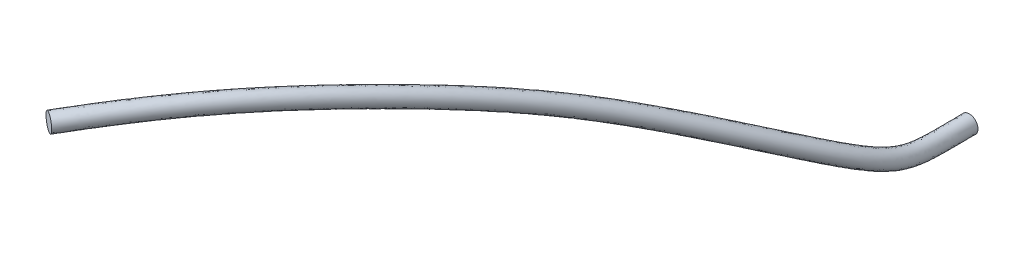
ISO-10303-21;
HEADER;
FILE_DESCRIPTION(('STEP AP214'),'2;1');
FILE_NAME('part.step','',(''),(''),'','','');
FILE_SCHEMA(('AUTOMOTIVE_DESIGN { 1 0 10303 214 1 1 1 1 }'));
ENDSEC;
DATA;
#1=APPLICATION_CONTEXT('core data for automotive mechanical design processes');
#2=APPLICATION_PROTOCOL_DEFINITION('international standard','automotive_design',2000,#1);
#3=PRODUCT_CONTEXT('',#1,'mechanical');
#4=PRODUCT('Part','Part','',(#3));
#5=PRODUCT_RELATED_PRODUCT_CATEGORY('part','',(#4));
#6=PRODUCT_DEFINITION_FORMATION('','',#4);
#7=PRODUCT_DEFINITION_CONTEXT('part definition',#1,'design');
#8=PRODUCT_DEFINITION('design','',#6,#7);
#9=PRODUCT_DEFINITION_SHAPE('','',#8);
#10=(LENGTH_UNIT() NAMED_UNIT(*) SI_UNIT(.MILLI.,.METRE.));
#11=(NAMED_UNIT(*) PLANE_ANGLE_UNIT() SI_UNIT($,.RADIAN.));
#12=(NAMED_UNIT(*) SI_UNIT($,.STERADIAN.) SOLID_ANGLE_UNIT());
#13=UNCERTAINTY_MEASURE_WITH_UNIT(LENGTH_MEASURE(1.E-05),#10,'distance_accuracy_value','');
#14=(GEOMETRIC_REPRESENTATION_CONTEXT(3) GLOBAL_UNCERTAINTY_ASSIGNED_CONTEXT((#13)) GLOBAL_UNIT_ASSIGNED_CONTEXT((#10,
#11,#12)) REPRESENTATION_CONTEXT('',''));
#15=CARTESIAN_POINT('',(0.,0.,0.));
#16=DIRECTION('',(0.,0.,1.));
#17=DIRECTION('',(1.,0.,0.));
#18=AXIS2_PLACEMENT_3D('',#15,#16,#17);
#19=CARTESIAN_POINT('',(0.,0.,0.));
#20=DIRECTION('',(0.,0.,1.));
#21=DIRECTION('',(1.,0.,0.));
#22=AXIS2_PLACEMENT_3D('',#19,#20,#21);
#23=PLANE('',#22);
#24=CARTESIAN_POINT('',(0.,0.,0.));
#25=DIRECTION('',(0.,0.,1.));
#26=DIRECTION('',(1.,0.,0.));
#27=AXIS2_PLACEMENT_3D('',#24,#25,#26);
#28=CIRCLE('',#27,1.15);
#29=CARTESIAN_POINT('',(1.15,0.,0.));
#30=VERTEX_POINT('',#29);
#31=EDGE_CURVE('E40',#30,#30,#28,.T.);
#32=ORIENTED_EDGE('',*,*,#31,.F.);
#33=EDGE_LOOP('',(#32));
#34=FACE_BOUND('',#33,.T.);
#35=ADVANCED_FACE('F33',(#34),#23,.F.);
#36=CARTESIAN_POINT('',(-40.1891861869022,21.1190555910862,82.0495406097306));
#37=DIRECTION('',(-0.523066911051622,-0.0173189381133083,0.852115638247264));
#38=DIRECTION('',(0.839482303165105,0.162216449648336,0.518608991568888));
#39=AXIS2_PLACEMENT_3D('',#36,#37,#38);
#40=PLANE('',#39);
#41=CARTESIAN_POINT('',(-40.1891861869022,21.1190555910862,82.0495406097306));
#42=DIRECTION('',(-0.523066911051622,-0.0173189381133083,0.852115638247264));
#43=DIRECTION('',(0.839482303165105,0.162216449648336,0.518608991568888));
#44=AXIS2_PLACEMENT_3D('',#41,#42,#43);
#45=CIRCLE('',#44,1.15);
#46=CARTESIAN_POINT('',(-39.2237815382624,21.3056045081818,82.6459409500348));
#47=VERTEX_POINT('',#46);
#48=EDGE_CURVE('E11',#47,#47,#45,.T.);
#49=ORIENTED_EDGE('',*,*,#48,.T.);
#50=EDGE_LOOP('',(#49));
#51=FACE_BOUND('',#50,.T.);
#52=ADVANCED_FACE('F47',(#51),#40,.T.);
#53=CARTESIAN_POINT('',(1.15,0.,0.));
#54=CARTESIAN_POINT('',(1.15000000144366,-7.20211161642477E-10,1.95143650964167));
#55=CARTESIAN_POINT('',(1.20622590283796,0.0180084902922004,3.51269738991182));
#56=CARTESIAN_POINT('',(1.28013739089192,0.168570841201481,6.23684377893701));
#57=CARTESIAN_POINT('',(1.29893429024295,0.301479833944161,7.4050627006684));
#58=CARTESIAN_POINT('',(1.12787614204195,0.77873712711421,9.69393493904792));
#59=CARTESIAN_POINT('',(0.934272869510342,1.12474594820879,10.8074515445958));
#60=CARTESIAN_POINT('',(0.189155180938306,2.07661842014926,13.2272806110371));
#61=CARTESIAN_POINT('',(-0.358717878546888,2.67981038190878,14.5346246022732));
#62=CARTESIAN_POINT('',(-2.40118231195554,4.64877181739815,18.6085088504666));
#63=CARTESIAN_POINT('',(-4.25852590368728,6.25441666013519,21.7817112451415));
#64=CARTESIAN_POINT('',(-8.39487169455971,9.60212919484409,28.7242194629464));
#65=CARTESIAN_POINT('',(-10.6722892268256,11.3418492196251,32.4883301998899));
#66=CARTESIAN_POINT('',(-16.1943113291562,15.2182645999995,42.1629616253261));
#67=CARTESIAN_POINT('',(-19.1049742099855,16.873554675777,47.8851708296531));
#68=CARTESIAN_POINT('',(-28.6572772561788,21.2475742907675,65.8311498474764));
#69=CARTESIAN_POINT('',(-33.8674574316434,21.4829543743858,73.920083058212));
#70=CARTESIAN_POINT('',(-39.2237815382624,21.3056045081818,82.6459409500348));
#71=CARTESIAN_POINT('',(1.15,2.3,0.));
#72=CARTESIAN_POINT('',(1.15000000151191,2.29999999930247,1.93691349664838));
#73=CARTESIAN_POINT('',(1.20537180512164,2.31877394118791,3.4630667389245));
#74=CARTESIAN_POINT('',(1.27510401661552,2.46080010755252,6.03277211417422));
#75=CARTESIAN_POINT('',(1.2905443755972,2.5820393650124,7.07456933034643));
#76=CARTESIAN_POINT('',(1.14042405579988,3.00135239054872,9.08559952774971));
#77=CARTESIAN_POINT('',(0.97423162480966,3.30269506927493,10.0637658770454));
#78=CARTESIAN_POINT('',(0.278860773719742,4.19112213316196,12.3223196141851));
#79=CARTESIAN_POINT('',(-0.25096579911246,4.7767658894762,13.5957672941097));
#80=CARTESIAN_POINT('',(-2.27549681623206,6.72843932638967,17.6338817739762));
#81=CARTESIAN_POINT('',(-4.13761803841304,8.33919031609541,20.8174997321641));
#82=CARTESIAN_POINT('',(-8.29719603013418,11.7057115446228,27.799014343803));
#83=CARTESIAN_POINT('',(-10.5938352821385,13.4607890788969,31.5942556798542));
#84=CARTESIAN_POINT('',(-16.2076410470252,17.4016358585136,41.4296928960429));
#85=CARTESIAN_POINT('',(-19.1633728120616,19.0815695694952,47.2405885551904));
#86=CARTESIAN_POINT('',(-28.8224850791944,23.5044973280292,65.3872307231536));
#87=CARTESIAN_POINT('',(-34.1725827128342,23.7532494545851,73.7038663408957));
#88=CARTESIAN_POINT('',(-39.5623620785418,23.5747918723732,82.4842253851126));
#89=CARTESIAN_POINT('',(-1.15,2.3,0.));
#90=CARTESIAN_POINT('',(-1.14999999844743,2.29999999931797,1.98109375578373));
#91=CARTESIAN_POINT('',(-1.09335271378284,2.32014159454708,3.54127108178073));
#92=CARTESIAN_POINT('',(-1.02448064835617,2.46042654646795,6.07927407132188));
#93=CARTESIAN_POINT('',(-1.01339852772852,2.57784666356256,7.04467796065394));
#94=CARTESIAN_POINT('',(-1.14336948493598,2.94110196114834,8.7860650291266));
#95=CARTESIAN_POINT('',(-1.27755783968144,3.18688499862361,9.58525494220966));
#96=CARTESIAN_POINT('',(-1.88948260265174,3.96878723043885,11.5727899771709));
#97=CARTESIAN_POINT('',(-2.3751498583266,4.50880916555192,12.7521322882529));
#98=CARTESIAN_POINT('',(-4.31976401325525,6.38344177870962,16.6308451806631));
#99=CARTESIAN_POINT('',(-6.16831964141897,7.98490835475729,19.79722648169));
#100=CARTESIAN_POINT('',(-10.3137992430629,11.3400256325171,26.7550758832065));
#101=CARTESIAN_POINT('',(-12.6130750402747,13.0976789708543,30.5542788450679));
#102=CARTESIAN_POINT('',(-18.260532088173,17.062148684274,40.4486734052187));
#103=CARTESIAN_POINT('',(-21.2238227033499,18.7439525252159,46.2750110932025));
#104=CARTESIAN_POINT('',(-30.8136418586378,23.1351507839293,64.2914718171081));
#105=CARTESIAN_POINT('',(-36.0923743904975,23.380516417844,72.4931171229209));
#106=CARTESIAN_POINT('',(-41.4931713758216,23.201694038182,81.2914247045041));
#107=CARTESIAN_POINT('',(-1.15,0.,0.));
#108=CARTESIAN_POINT('',(-1.14999999851569,-7.04714786313529E-10,1.99561676877702));
#109=CARTESIAN_POINT('',(-1.09249861606652,0.0193761436513657,3.59090173276806));
#110=CARTESIAN_POINT('',(-1.01944727407976,0.168197280116911,6.28334573608467));
#111=CARTESIAN_POINT('',(-1.00500861308276,0.297287132494317,7.37517133097591));
#112=CARTESIAN_POINT('',(-1.15591739869391,0.718486697713824,9.39440044042481));
#113=CARTESIAN_POINT('',(-1.31751659498076,1.00893587755733,10.3289406097601));
#114=CARTESIAN_POINT('',(-1.97918819543318,1.85428351742629,12.4777509740229));
#115=CARTESIAN_POINT('',(-2.48290193776103,2.4118536579845,13.690989596414));
#116=CARTESIAN_POINT('',(-4.44544950897873,4.30377426971809,17.6054722571574));
#117=CARTESIAN_POINT('',(-6.28922750669226,5.90013469879612,20.7614379946674));
#118=CARTESIAN_POINT('',(-10.4114749074894,9.23644328273934,27.6802810023499));
#119=CARTESIAN_POINT('',(-12.6915289849599,10.9787391115826,31.4483533651036));
#120=CARTESIAN_POINT('',(-18.2472023703073,14.8787774257598,41.181942134502));
#121=CARTESIAN_POINT('',(-21.1654241012737,16.5359376315027,46.9195933676652));
#122=CARTESIAN_POINT('',(-30.6484340356222,20.8782277466547,64.7353909414309));
#123=CARTESIAN_POINT('',(-35.7872491093066,21.1102213376447,72.7093338402372));
#124=CARTESIAN_POINT('',(-41.1545908355421,20.9325066739906,81.4531402694264));
#125=CARTESIAN_POINT('',(-1.15,-2.3,0.));
#126=CARTESIAN_POINT('',(-1.14999999858395,-2.3000000007274,2.01013978177032));
#127=CARTESIAN_POINT('',(-1.09164451835021,-2.28138930724435,3.64053238375538));
#128=CARTESIAN_POINT('',(-1.01441389980336,-2.12403198623413,6.48741740084747));
#129=CARTESIAN_POINT('',(-0.99661869843701,-1.98327239857393,7.70566470129788));
#130=CARTESIAN_POINT('',(-1.16846531245183,-1.50412856572069,10.002735851723));
#131=CARTESIAN_POINT('',(-1.35747535028008,-1.16901324350895,11.0726262773105));
#132=CARTESIAN_POINT('',(-2.06889378821462,-0.260220195586268,13.3827119708749));
#133=CARTESIAN_POINT('',(-2.59065401719546,0.314898150417083,14.629846904575));
#134=CARTESIAN_POINT('',(-4.57113500470221,2.22410676072657,18.5800993336516));
#135=CARTESIAN_POINT('',(-6.41013537196555,3.81536104283495,21.7256495076448));
#136=CARTESIAN_POINT('',(-10.5091505719158,7.1328609329616,28.6054861214933));
#137=CARTESIAN_POINT('',(-12.7699829296452,8.85979925231079,32.3424278851393));
#138=CARTESIAN_POINT('',(-18.2338726524415,12.6954061672456,41.9152108637853));
#139=CARTESIAN_POINT('',(-21.1070254991976,14.3279227377894,47.5641756421279));
#140=CARTESIAN_POINT('',(-30.4832262126066,18.6213047093801,65.1793100657537));
#141=CARTESIAN_POINT('',(-35.4821238281157,18.8399262574453,72.9255505575534));
#142=CARTESIAN_POINT('',(-40.8160102952627,18.6633193097992,81.6148558343486));
#143=CARTESIAN_POINT('',(1.15,-2.3,0.));
#144=CARTESIAN_POINT('',(1.1500000013754,-2.30000000074289,1.96595952263497));
#145=CARTESIAN_POINT('',(1.20708000055428,-2.28275696060351,3.56232804089915));
#146=CARTESIAN_POINT('',(1.28517076516832,-2.12365842514956,6.44091544369981));
#147=CARTESIAN_POINT('',(1.3073242048887,-1.97907969712408,7.73555607099037));
#148=CARTESIAN_POINT('',(1.11532822828403,-1.4438781363203,10.3022703503461));
#149=CARTESIAN_POINT('',(0.894314114211023,-1.05320317285736,11.5511372121463));
#150=CARTESIAN_POINT('',(0.0994495881568704,-0.0378852928634389,14.1322416078891));
#151=CARTESIAN_POINT('',(-0.466469957981315,0.582854874341361,15.4734819104367));
#152=CARTESIAN_POINT('',(-2.52686780767902,2.56910430840662,19.583135926957));
#153=CARTESIAN_POINT('',(-4.37943376896151,4.16964300417496,22.7459227581189));
#154=CARTESIAN_POINT('',(-8.49254735898525,7.4985468450654,29.6494245820898));
#155=CARTESIAN_POINT('',(-10.7507431715128,9.22290936035332,33.3824047199256));
#156=CARTESIAN_POINT('',(-16.1809816112873,13.0348933414853,42.8962303546094));
#157=CARTESIAN_POINT('',(-19.0465756079094,14.6655397820587,48.5297531041157));
#158=CARTESIAN_POINT('',(-28.4920694331632,18.9906512535058,66.2750689717992));
#159=CARTESIAN_POINT('',(-33.5623321504525,19.2126592941865,74.1362997755283));
#160=CARTESIAN_POINT('',(-38.8852009979829,19.0364171439904,82.807656514957));
#161=CARTESIAN_POINT('',(1.15,0.,0.));
#162=CARTESIAN_POINT('',(1.15000000144366,-7.20211161642477E-10,1.95143650964167));
#163=CARTESIAN_POINT('',(1.20622590283796,0.0180084902922004,3.51269738991182));
#164=CARTESIAN_POINT('',(1.28013739089192,0.168570841201481,6.23684377893701));
#165=CARTESIAN_POINT('',(1.29893429024295,0.301479833944161,7.4050627006684));
#166=CARTESIAN_POINT('',(1.12787614204195,0.77873712711421,9.69393493904792));
#167=CARTESIAN_POINT('',(0.934272869510342,1.12474594820879,10.8074515445958));
#168=CARTESIAN_POINT('',(0.189155180938306,2.07661842014926,13.2272806110371));
#169=CARTESIAN_POINT('',(-0.358717878546888,2.67981038190878,14.5346246022732));
#170=CARTESIAN_POINT('',(-2.40118231195554,4.64877181739815,18.6085088504666));
#171=CARTESIAN_POINT('',(-4.25852590368728,6.25441666013519,21.7817112451415));
#172=CARTESIAN_POINT('',(-8.39487169455971,9.60212919484409,28.7242194629464));
#173=CARTESIAN_POINT('',(-10.6722892268256,11.3418492196251,32.4883301998899));
#174=CARTESIAN_POINT('',(-16.1943113291562,15.2182645999995,42.1629616253261));
#175=CARTESIAN_POINT('',(-19.1049742099855,16.873554675777,47.8851708296531));
#176=CARTESIAN_POINT('',(-28.6572772561788,21.2475742907675,65.8311498474764));
#177=CARTESIAN_POINT('',(-33.8674574316434,21.4829543743858,73.920083058212));
#178=CARTESIAN_POINT('',(-39.2237815382624,21.3056045081818,82.6459409500348));
#179=(BOUNDED_SURFACE() B_SPLINE_SURFACE(3,3,((#53,#54,#55,#56,#57,#58,#59,#60,#61,#62,#63,#64,
#65,#66,#67,#68,#69,#70),(#71,#72,#73,#74,#75,#76,#77,#78,#79,#80,#81,#82,#83,#84,#85,#86,#87,
#88),(#89,#90,#91,#92,#93,#94,#95,#96,#97,#98,#99,#100,#101,#102,#103,#104,#105,#106),(#107,
#108,#109,#110,#111,#112,#113,#114,#115,#116,#117,#118,#119,#120,#121,#122,#123,#124),(#125,
#126,#127,#128,#129,#130,#131,#132,#133,#134,#135,#136,#137,#138,#139,#140,#141,#142),(#143,
#144,#145,#146,#147,#148,#149,#150,#151,#152,#153,#154,#155,#156,#157,#158,#159,#160),(#161,
#162,#163,#164,#165,#166,#167,#168,#169,#170,#171,#172,#173,#174,#175,#176,#177,#178)),
.UNSPECIFIED.,.T.,.F.,.F.) B_SPLINE_SURFACE_WITH_KNOTS((4,3,4),(4,2,2,2,2,2,2,2,4),(0.,0.5,1.),
(0.,0.0605175553157011,0.121035110631402,0.181552665947103,0.242070221262805,0.337545074726631,
0.433019928190457,0.591544001721442,1.),
.UNSPECIFIED.) GEOMETRIC_REPRESENTATION_ITEM() RATIONAL_B_SPLINE_SURFACE(((1.,1.,1.,1.,1.,1.,1.,
1.,1.,1.,1.,1.,1.,1.,1.,1.,1.,1.),(0.333333333333333,0.333333333333333,0.333333333333333,
0.333333333333333,0.333333333333333,0.333333333333333,0.333333333333333,0.333333333333333,
0.333333333333333,0.333333333333333,0.333333333333333,0.333333333333333,0.333333333333333,
0.333333333333333,0.333333333333333,0.333333333333333,0.333333333333333,0.333333333333333),
(0.333333333333333,0.333333333333333,0.333333333333333,0.333333333333333,0.333333333333333,
0.333333333333333,0.333333333333333,0.333333333333333,0.333333333333333,0.333333333333333,
0.333333333333333,0.333333333333333,0.333333333333333,0.333333333333333,0.333333333333333,
0.333333333333333,0.333333333333333,0.333333333333333),(1.,1.,1.,1.,1.,1.,1.,1.,1.,1.,1.,1.,1.,
1.,1.,1.,1.,1.),(0.333333333333333,0.333333333333333,0.333333333333333,0.333333333333333,
0.333333333333333,0.333333333333333,0.333333333333333,0.333333333333333,0.333333333333333,
0.333333333333333,0.333333333333333,0.333333333333333,0.333333333333333,0.333333333333333,
0.333333333333333,0.333333333333333,0.333333333333333,0.333333333333333),(0.333333333333333,
0.333333333333333,0.333333333333333,0.333333333333333,0.333333333333333,0.333333333333333,
0.333333333333333,0.333333333333333,0.333333333333333,0.333333333333333,0.333333333333333,
0.333333333333333,0.333333333333333,0.333333333333333,0.333333333333333,0.333333333333333,
0.333333333333333,0.333333333333333),(1.,1.,1.,1.,1.,1.,1.,1.,1.,1.,1.,1.,1.,1.,1.,1.,1.,1.))) REPRESENTATION_ITEM('') SURFACE());
#180=ORIENTED_EDGE('',*,*,#48,.F.);
#181=EDGE_LOOP('',(#180));
#182=FACE_BOUND('',#181,.T.);
#183=ORIENTED_EDGE('',*,*,#31,.T.);
#184=EDGE_LOOP('',(#183));
#185=FACE_BOUND('',#184,.T.);
#186=ADVANCED_FACE('F49',(#182,#185),#179,.T.);
#187=CLOSED_SHELL('',(#35,#52,#186));
#188=MANIFOLD_SOLID_BREP('B2',#187);
#189=ADVANCED_BREP_SHAPE_REPRESENTATION('',(#18,#188),#14);
#190=SHAPE_DEFINITION_REPRESENTATION(#9,#189);
ENDSEC;
END-ISO-10303-21;
